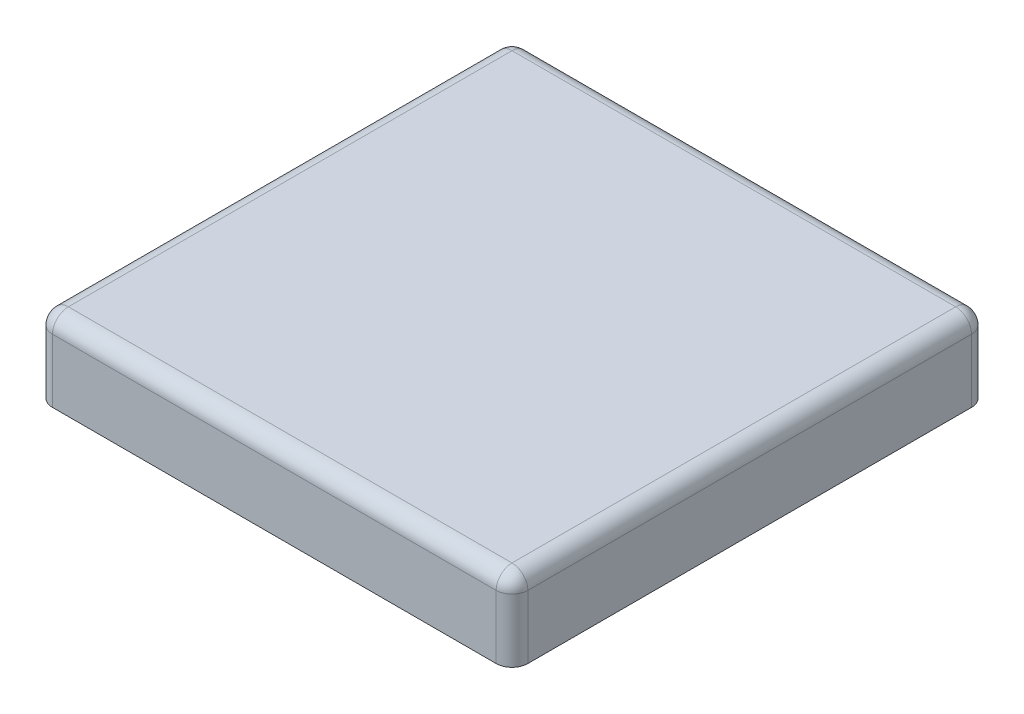
ISO-10303-21;
HEADER;
FILE_DESCRIPTION(('STEP AP214'),'2;1');
FILE_NAME('part.step','',(''),(''),'','','');
FILE_SCHEMA(('AUTOMOTIVE_DESIGN { 1 0 10303 214 1 1 1 1 }'));
ENDSEC;
DATA;
#1=APPLICATION_CONTEXT('core data for automotive mechanical design processes');
#2=APPLICATION_PROTOCOL_DEFINITION('international standard','automotive_design',2000,#1);
#3=PRODUCT_CONTEXT('',#1,'mechanical');
#4=PRODUCT('Part','Part','',(#3));
#5=PRODUCT_RELATED_PRODUCT_CATEGORY('part','',(#4));
#6=PRODUCT_DEFINITION_FORMATION('','',#4);
#7=PRODUCT_DEFINITION_CONTEXT('part definition',#1,'design');
#8=PRODUCT_DEFINITION('design','',#6,#7);
#9=PRODUCT_DEFINITION_SHAPE('','',#8);
#10=(LENGTH_UNIT() NAMED_UNIT(*) SI_UNIT(.MILLI.,.METRE.));
#11=(NAMED_UNIT(*) PLANE_ANGLE_UNIT() SI_UNIT($,.RADIAN.));
#12=(NAMED_UNIT(*) SI_UNIT($,.STERADIAN.) SOLID_ANGLE_UNIT());
#13=UNCERTAINTY_MEASURE_WITH_UNIT(LENGTH_MEASURE(1.E-05),#10,'distance_accuracy_value','');
#14=(GEOMETRIC_REPRESENTATION_CONTEXT(3) GLOBAL_UNCERTAINTY_ASSIGNED_CONTEXT((#13)) GLOBAL_UNIT_ASSIGNED_CONTEXT((#10,
#11,#12)) REPRESENTATION_CONTEXT('',''));
#15=CARTESIAN_POINT('',(0.,0.,0.));
#16=DIRECTION('',(0.,0.,1.));
#17=DIRECTION('',(1.,0.,0.));
#18=AXIS2_PLACEMENT_3D('',#15,#16,#17);
#19=CARTESIAN_POINT('',(-150.,50.,150.));
#20=DIRECTION('',(1.,0.,0.));
#21=DIRECTION('',(0.,0.,-1.));
#22=AXIS2_PLACEMENT_3D('',#19,#20,#21);
#23=PLANE('',#22);
#24=DIRECTION('',(0.,0.,1.));
#25=VECTOR('',#24,1.);
#26=CARTESIAN_POINT('',(-150.,40.,-150.));
#27=LINE('',#26,#25);
#28=CARTESIAN_POINT('',(-150.,40.,140.));
#29=VERTEX_POINT('',#28);
#30=CARTESIAN_POINT('',(-150.,40.,-140.));
#31=VERTEX_POINT('',#30);
#32=EDGE_CURVE('E182',#29,#31,#27,.F.);
#33=ORIENTED_EDGE('',*,*,#32,.T.);
#34=DIRECTION('',(0.,-1.,0.));
#35=VECTOR('',#34,1.);
#36=CARTESIAN_POINT('',(-150.,50.,-140.));
#37=LINE('',#36,#35);
#38=CARTESIAN_POINT('',(-150.,0.,-140.));
#39=VERTEX_POINT('',#38);
#40=EDGE_CURVE('E185',#31,#39,#37,.T.);
#41=ORIENTED_EDGE('',*,*,#40,.T.);
#42=DIRECTION('',(0.,0.,1.));
#43=VECTOR('',#42,1.);
#44=CARTESIAN_POINT('',(-150.,0.,150.));
#45=LINE('',#44,#43);
#46=CARTESIAN_POINT('',(-150.,0.,140.));
#47=VERTEX_POINT('',#46);
#48=EDGE_CURVE('E235',#39,#47,#45,.T.);
#49=ORIENTED_EDGE('',*,*,#48,.T.);
#50=DIRECTION('',(0.,-1.,0.));
#51=VECTOR('',#50,1.);
#52=CARTESIAN_POINT('',(-150.,50.,140.));
#53=LINE('',#52,#51);
#54=EDGE_CURVE('E179',#47,#29,#53,.F.);
#55=ORIENTED_EDGE('',*,*,#54,.T.);
#56=EDGE_LOOP('',(#33,#41,#49,#55));
#57=FACE_BOUND('',#56,.T.);
#58=ADVANCED_FACE('F39',(#57),#23,.F.);
#59=CARTESIAN_POINT('',(150.,50.,150.));
#60=DIRECTION('',(0.,0.,-1.));
#61=DIRECTION('',(-1.,0.,0.));
#62=AXIS2_PLACEMENT_3D('',#59,#60,#61);
#63=PLANE('',#62);
#64=DIRECTION('',(1.,0.,0.));
#65=VECTOR('',#64,1.);
#66=CARTESIAN_POINT('',(150.,0.,150.));
#67=LINE('',#66,#65);
#68=CARTESIAN_POINT('',(-140.,0.,150.));
#69=VERTEX_POINT('',#68);
#70=CARTESIAN_POINT('',(140.,0.,150.));
#71=VERTEX_POINT('',#70);
#72=EDGE_CURVE('E239',#69,#71,#67,.T.);
#73=ORIENTED_EDGE('',*,*,#72,.T.);
#74=DIRECTION('',(0.,-1.,0.));
#75=VECTOR('',#74,1.);
#76=CARTESIAN_POINT('',(140.,50.,150.));
#77=LINE('',#76,#75);
#78=CARTESIAN_POINT('',(140.,40.,150.));
#79=VERTEX_POINT('',#78);
#80=EDGE_CURVE('E176',#71,#79,#77,.F.);
#81=ORIENTED_EDGE('',*,*,#80,.T.);
#82=DIRECTION('',(1.,0.,0.));
#83=VECTOR('',#82,1.);
#84=CARTESIAN_POINT('',(-150.,40.,150.));
#85=LINE('',#84,#83);
#86=CARTESIAN_POINT('',(-140.,40.,150.));
#87=VERTEX_POINT('',#86);
#88=EDGE_CURVE('E173',#79,#87,#85,.F.);
#89=ORIENTED_EDGE('',*,*,#88,.T.);
#90=DIRECTION('',(0.,-1.,0.));
#91=VECTOR('',#90,1.);
#92=CARTESIAN_POINT('',(-140.,50.,150.));
#93=LINE('',#92,#91);
#94=EDGE_CURVE('E170',#87,#69,#93,.T.);
#95=ORIENTED_EDGE('',*,*,#94,.T.);
#96=EDGE_LOOP('',(#73,#81,#89,#95));
#97=FACE_BOUND('',#96,.T.);
#98=ADVANCED_FACE('F297',(#97),#63,.F.);
#99=CARTESIAN_POINT('',(150.,50.,150.));
#100=DIRECTION('',(-1.,0.,0.));
#101=DIRECTION('',(0.,0.,1.));
#102=AXIS2_PLACEMENT_3D('',#99,#100,#101);
#103=PLANE('',#102);
#104=DIRECTION('',(0.,0.,-1.));
#105=VECTOR('',#104,1.);
#106=CARTESIAN_POINT('',(150.,0.,150.));
#107=LINE('',#106,#105);
#108=CARTESIAN_POINT('',(150.,0.,140.));
#109=VERTEX_POINT('',#108);
#110=CARTESIAN_POINT('',(150.,0.,-140.));
#111=VERTEX_POINT('',#110);
#112=EDGE_CURVE('E246',#109,#111,#107,.T.);
#113=ORIENTED_EDGE('',*,*,#112,.T.);
#114=DIRECTION('',(0.,-1.,0.));
#115=VECTOR('',#114,1.);
#116=CARTESIAN_POINT('',(150.,50.,-140.));
#117=LINE('',#116,#115);
#118=CARTESIAN_POINT('',(150.,40.,-140.));
#119=VERTEX_POINT('',#118);
#120=EDGE_CURVE('E167',#111,#119,#117,.F.);
#121=ORIENTED_EDGE('',*,*,#120,.T.);
#122=DIRECTION('',(0.,0.,-1.));
#123=VECTOR('',#122,1.);
#124=CARTESIAN_POINT('',(150.,40.,150.));
#125=LINE('',#124,#123);
#126=CARTESIAN_POINT('',(150.,40.,140.));
#127=VERTEX_POINT('',#126);
#128=EDGE_CURVE('E125',#119,#127,#125,.F.);
#129=ORIENTED_EDGE('',*,*,#128,.T.);
#130=DIRECTION('',(0.,-1.,0.));
#131=VECTOR('',#130,1.);
#132=CARTESIAN_POINT('',(150.,50.,140.));
#133=LINE('',#132,#131);
#134=EDGE_CURVE('E157',#127,#109,#133,.T.);
#135=ORIENTED_EDGE('',*,*,#134,.T.);
#136=EDGE_LOOP('',(#113,#121,#129,#135));
#137=FACE_BOUND('',#136,.T.);
#138=ADVANCED_FACE('F273',(#137),#103,.F.);
#139=CARTESIAN_POINT('',(150.,50.,-150.));
#140=DIRECTION('',(0.,0.,1.));
#141=DIRECTION('',(1.,0.,0.));
#142=AXIS2_PLACEMENT_3D('',#139,#140,#141);
#143=PLANE('',#142);
#144=DIRECTION('',(-1.,0.,0.));
#145=VECTOR('',#144,1.);
#146=CARTESIAN_POINT('',(150.,0.,-150.));
#147=LINE('',#146,#145);
#148=CARTESIAN_POINT('',(140.,0.,-150.));
#149=VERTEX_POINT('',#148);
#150=CARTESIAN_POINT('',(-140.,0.,-150.));
#151=VERTEX_POINT('',#150);
#152=EDGE_CURVE('E150',#149,#151,#147,.T.);
#153=ORIENTED_EDGE('',*,*,#152,.T.);
#154=DIRECTION('',(0.,-1.,0.));
#155=VECTOR('',#154,1.);
#156=CARTESIAN_POINT('',(-140.,50.,-150.));
#157=LINE('',#156,#155);
#158=CARTESIAN_POINT('',(-140.,40.,-150.));
#159=VERTEX_POINT('',#158);
#160=EDGE_CURVE('E57',#151,#159,#157,.F.);
#161=ORIENTED_EDGE('',*,*,#160,.T.);
#162=DIRECTION('',(-1.,0.,0.));
#163=VECTOR('',#162,1.);
#164=CARTESIAN_POINT('',(150.,40.,-150.));
#165=LINE('',#164,#163);
#166=CARTESIAN_POINT('',(140.,40.,-150.));
#167=VERTEX_POINT('',#166);
#168=EDGE_CURVE('E62',#159,#167,#165,.F.);
#169=ORIENTED_EDGE('',*,*,#168,.T.);
#170=DIRECTION('',(0.,-1.,0.));
#171=VECTOR('',#170,1.);
#172=CARTESIAN_POINT('',(140.,50.,-150.));
#173=LINE('',#172,#171);
#174=EDGE_CURVE('E188',#167,#149,#173,.T.);
#175=ORIENTED_EDGE('',*,*,#174,.T.);
#176=EDGE_LOOP('',(#153,#161,#169,#175));
#177=FACE_BOUND('',#176,.T.);
#178=ADVANCED_FACE('F279',(#177),#143,.F.);
#179=CARTESIAN_POINT('',(0.,50.,0.));
#180=DIRECTION('',(0.,1.,0.));
#181=DIRECTION('',(0.,0.,1.));
#182=AXIS2_PLACEMENT_3D('',#179,#180,#181);
#183=PLANE('',#182);
#184=DIRECTION('',(1.,0.,0.));
#185=VECTOR('',#184,1.);
#186=CARTESIAN_POINT('',(150.,50.,140.));
#187=LINE('',#186,#185);
#188=CARTESIAN_POINT('',(-140.,50.,140.));
#189=VERTEX_POINT('',#188);
#190=CARTESIAN_POINT('',(140.,50.,140.));
#191=VERTEX_POINT('',#190);
#192=EDGE_CURVE('E154',#189,#191,#187,.T.);
#193=ORIENTED_EDGE('',*,*,#192,.T.);
#194=DIRECTION('',(0.,0.,-1.));
#195=VECTOR('',#194,1.);
#196=CARTESIAN_POINT('',(140.,50.,-150.));
#197=LINE('',#196,#195);
#198=CARTESIAN_POINT('',(140.,50.,-140.));
#199=VERTEX_POINT('',#198);
#200=EDGE_CURVE('E123',#191,#199,#197,.T.);
#201=ORIENTED_EDGE('',*,*,#200,.T.);
#202=DIRECTION('',(-1.,0.,0.));
#203=VECTOR('',#202,1.);
#204=CARTESIAN_POINT('',(-150.,50.,-140.));
#205=LINE('',#204,#203);
#206=CARTESIAN_POINT('',(-140.,50.,-140.));
#207=VERTEX_POINT('',#206);
#208=EDGE_CURVE('E142',#199,#207,#205,.T.);
#209=ORIENTED_EDGE('',*,*,#208,.T.);
#210=DIRECTION('',(0.,0.,1.));
#211=VECTOR('',#210,1.);
#212=CARTESIAN_POINT('',(-140.,50.,150.));
#213=LINE('',#212,#211);
#214=EDGE_CURVE('E149',#207,#189,#213,.T.);
#215=ORIENTED_EDGE('',*,*,#214,.T.);
#216=EDGE_LOOP('',(#193,#201,#209,#215));
#217=FACE_BOUND('',#216,.T.);
#218=ADVANCED_FACE('F152',(#217),#183,.T.);
#219=CARTESIAN_POINT('',(0.,0.,0.));
#220=DIRECTION('',(0.,1.,0.));
#221=DIRECTION('',(0.,0.,1.));
#222=AXIS2_PLACEMENT_3D('',#219,#220,#221);
#223=PLANE('',#222);
#224=ORIENTED_EDGE('',*,*,#48,.F.);
#225=CARTESIAN_POINT('',(-140.,0.,-140.));
#226=DIRECTION('',(0.,1.,0.));
#227=DIRECTION('',(0.,0.,1.));
#228=AXIS2_PLACEMENT_3D('',#225,#226,#227);
#229=CIRCLE('',#228,10.);
#230=EDGE_CURVE('E11',#39,#151,#229,.F.);
#231=ORIENTED_EDGE('',*,*,#230,.T.);
#232=ORIENTED_EDGE('',*,*,#152,.F.);
#233=CARTESIAN_POINT('',(140.,0.,-140.));
#234=DIRECTION('',(0.,1.,0.));
#235=DIRECTION('',(0.,0.,1.));
#236=AXIS2_PLACEMENT_3D('',#233,#234,#235);
#237=CIRCLE('',#236,10.);
#238=EDGE_CURVE('E49',#149,#111,#237,.F.);
#239=ORIENTED_EDGE('',*,*,#238,.T.);
#240=ORIENTED_EDGE('',*,*,#112,.F.);
#241=CARTESIAN_POINT('',(140.,0.,140.));
#242=DIRECTION('',(0.,1.,0.));
#243=DIRECTION('',(0.,0.,1.));
#244=AXIS2_PLACEMENT_3D('',#241,#242,#243);
#245=CIRCLE('',#244,10.);
#246=EDGE_CURVE('E198',#109,#71,#245,.F.);
#247=ORIENTED_EDGE('',*,*,#246,.T.);
#248=ORIENTED_EDGE('',*,*,#72,.F.);
#249=CARTESIAN_POINT('',(-140.,0.,140.));
#250=DIRECTION('',(0.,1.,0.));
#251=DIRECTION('',(0.,0.,1.));
#252=AXIS2_PLACEMENT_3D('',#249,#250,#251);
#253=CIRCLE('',#252,10.);
#254=EDGE_CURVE('E195',#69,#47,#253,.F.);
#255=ORIENTED_EDGE('',*,*,#254,.T.);
#256=EDGE_LOOP('',(#224,#231,#232,#239,#240,#247,#248,#255));
#257=FACE_BOUND('',#256,.T.);
#258=ADVANCED_FACE('F281',(#257),#223,.F.);
#259=CARTESIAN_POINT('',(-140.,50.,140.));
#260=DIRECTION('',(0.,-1.,0.));
#261=DIRECTION('',(0.,0.,-1.));
#262=AXIS2_PLACEMENT_3D('',#259,#260,#261);
#263=CYLINDRICAL_SURFACE('',#262,10.);
#264=ORIENTED_EDGE('',*,*,#254,.F.);
#265=ORIENTED_EDGE('',*,*,#94,.F.);
#266=CARTESIAN_POINT('',(-140.,40.,140.));
#267=DIRECTION('',(0.,1.,0.));
#268=DIRECTION('',(0.,0.,1.));
#269=AXIS2_PLACEMENT_3D('',#266,#267,#268);
#270=CIRCLE('',#269,10.);
#271=EDGE_CURVE('E43',#29,#87,#270,.T.);
#272=ORIENTED_EDGE('',*,*,#271,.F.);
#273=ORIENTED_EDGE('',*,*,#54,.F.);
#274=EDGE_LOOP('',(#264,#265,#272,#273));
#275=FACE_BOUND('',#274,.T.);
#276=ADVANCED_FACE('F41',(#275),#263,.T.);
#277=CARTESIAN_POINT('',(-140.,40.,0.));
#278=DIRECTION('',(0.,0.,-1.));
#279=DIRECTION('',(-1.,0.,0.));
#280=AXIS2_PLACEMENT_3D('',#277,#278,#279);
#281=CYLINDRICAL_SURFACE('',#280,10.);
#282=CARTESIAN_POINT('',(-140.,40.,-140.));
#283=DIRECTION('',(0.,0.,-1.));
#284=DIRECTION('',(-1.,0.,0.));
#285=AXIS2_PLACEMENT_3D('',#282,#283,#284);
#286=CIRCLE('',#285,10.);
#287=EDGE_CURVE('E224',#31,#207,#286,.T.);
#288=ORIENTED_EDGE('',*,*,#287,.F.);
#289=ORIENTED_EDGE('',*,*,#32,.F.);
#290=CARTESIAN_POINT('',(-140.,40.,140.));
#291=DIRECTION('',(0.,0.,1.));
#292=DIRECTION('',(1.,0.,0.));
#293=AXIS2_PLACEMENT_3D('',#290,#291,#292);
#294=CIRCLE('',#293,10.);
#295=EDGE_CURVE('E227',#189,#29,#294,.T.);
#296=ORIENTED_EDGE('',*,*,#295,.F.);
#297=ORIENTED_EDGE('',*,*,#214,.F.);
#298=EDGE_LOOP('',(#288,#289,#296,#297));
#299=FACE_BOUND('',#298,.T.);
#300=ADVANCED_FACE('F257',(#299),#281,.T.);
#301=CARTESIAN_POINT('',(-140.,50.,-140.));
#302=DIRECTION('',(0.,-1.,0.));
#303=DIRECTION('',(0.,0.,-1.));
#304=AXIS2_PLACEMENT_3D('',#301,#302,#303);
#305=CYLINDRICAL_SURFACE('',#304,10.);
#306=ORIENTED_EDGE('',*,*,#230,.F.);
#307=ORIENTED_EDGE('',*,*,#40,.F.);
#308=CARTESIAN_POINT('',(-140.,40.,-140.));
#309=DIRECTION('',(0.,1.,0.));
#310=DIRECTION('',(0.,0.,1.));
#311=AXIS2_PLACEMENT_3D('',#308,#309,#310);
#312=CIRCLE('',#311,10.);
#313=EDGE_CURVE('E220',#159,#31,#312,.T.);
#314=ORIENTED_EDGE('',*,*,#313,.F.);
#315=ORIENTED_EDGE('',*,*,#160,.F.);
#316=EDGE_LOOP('',(#306,#307,#314,#315));
#317=FACE_BOUND('',#316,.T.);
#318=ADVANCED_FACE('F285',(#317),#305,.T.);
#319=CARTESIAN_POINT('',(-140.,40.,140.));
#320=DIRECTION('',(-1.,0.,0.));
#321=DIRECTION('',(0.,0.,1.));
#322=AXIS2_PLACEMENT_3D('',#319,#320,#321);
#323=SPHERICAL_SURFACE('',#322,10.);
#324=ORIENTED_EDGE('',*,*,#295,.T.);
#325=ORIENTED_EDGE('',*,*,#271,.T.);
#326=CARTESIAN_POINT('',(-140.,40.,140.));
#327=DIRECTION('',(-1.,0.,0.));
#328=DIRECTION('',(0.,0.,1.));
#329=AXIS2_PLACEMENT_3D('',#326,#327,#328);
#330=CIRCLE('',#329,10.);
#331=EDGE_CURVE('E216',#189,#87,#330,.F.);
#332=ORIENTED_EDGE('',*,*,#331,.F.);
#333=EDGE_LOOP('',(#324,#325,#332));
#334=FACE_BOUND('',#333,.T.);
#335=ADVANCED_FACE('F258',(#334),#323,.T.);
#336=CARTESIAN_POINT('',(-140.,40.,-140.));
#337=DIRECTION('',(-1.,0.,0.));
#338=DIRECTION('',(0.,0.,1.));
#339=AXIS2_PLACEMENT_3D('',#336,#337,#338);
#340=SPHERICAL_SURFACE('',#339,10.);
#341=ORIENTED_EDGE('',*,*,#313,.T.);
#342=ORIENTED_EDGE('',*,*,#287,.T.);
#343=CARTESIAN_POINT('',(-140.,40.,-140.));
#344=DIRECTION('',(-1.,0.,0.));
#345=DIRECTION('',(0.,0.,1.));
#346=AXIS2_PLACEMENT_3D('',#343,#344,#345);
#347=CIRCLE('',#346,10.);
#348=EDGE_CURVE('E145',#159,#207,#347,.F.);
#349=ORIENTED_EDGE('',*,*,#348,.F.);
#350=EDGE_LOOP('',(#341,#342,#349));
#351=FACE_BOUND('',#350,.T.);
#352=ADVANCED_FACE('F287',(#351),#340,.T.);
#353=CARTESIAN_POINT('',(140.,50.,140.));
#354=DIRECTION('',(0.,-1.,0.));
#355=DIRECTION('',(0.,0.,-1.));
#356=AXIS2_PLACEMENT_3D('',#353,#354,#355);
#357=CYLINDRICAL_SURFACE('',#356,10.);
#358=ORIENTED_EDGE('',*,*,#246,.F.);
#359=ORIENTED_EDGE('',*,*,#134,.F.);
#360=CARTESIAN_POINT('',(140.,40.,140.));
#361=DIRECTION('',(0.,1.,0.));
#362=DIRECTION('',(0.,0.,1.));
#363=AXIS2_PLACEMENT_3D('',#360,#361,#362);
#364=CIRCLE('',#363,10.);
#365=EDGE_CURVE('E210',#79,#127,#364,.T.);
#366=ORIENTED_EDGE('',*,*,#365,.F.);
#367=ORIENTED_EDGE('',*,*,#80,.F.);
#368=EDGE_LOOP('',(#358,#359,#366,#367));
#369=FACE_BOUND('',#368,.T.);
#370=ADVANCED_FACE('F270',(#369),#357,.T.);
#371=CARTESIAN_POINT('',(0.,40.,140.));
#372=DIRECTION('',(-1.,0.,0.));
#373=DIRECTION('',(0.,0.,1.));
#374=AXIS2_PLACEMENT_3D('',#371,#372,#373);
#375=CYLINDRICAL_SURFACE('',#374,10.);
#376=ORIENTED_EDGE('',*,*,#331,.T.);
#377=ORIENTED_EDGE('',*,*,#88,.F.);
#378=CARTESIAN_POINT('',(140.,40.,140.));
#379=DIRECTION('',(1.,0.,0.));
#380=DIRECTION('',(0.,0.,-1.));
#381=AXIS2_PLACEMENT_3D('',#378,#379,#380);
#382=CIRCLE('',#381,10.);
#383=EDGE_CURVE('E139',#191,#79,#382,.T.);
#384=ORIENTED_EDGE('',*,*,#383,.F.);
#385=ORIENTED_EDGE('',*,*,#192,.F.);
#386=EDGE_LOOP('',(#376,#377,#384,#385));
#387=FACE_BOUND('',#386,.T.);
#388=ADVANCED_FACE('F261',(#387),#375,.T.);
#389=CARTESIAN_POINT('',(0.,40.,-140.));
#390=DIRECTION('',(1.,0.,0.));
#391=DIRECTION('',(0.,0.,-1.));
#392=AXIS2_PLACEMENT_3D('',#389,#390,#391);
#393=CYLINDRICAL_SURFACE('',#392,10.);
#394=ORIENTED_EDGE('',*,*,#348,.T.);
#395=ORIENTED_EDGE('',*,*,#208,.F.);
#396=CARTESIAN_POINT('',(140.,40.,-140.));
#397=DIRECTION('',(1.,0.,0.));
#398=DIRECTION('',(0.,0.,-1.));
#399=AXIS2_PLACEMENT_3D('',#396,#397,#398);
#400=CIRCLE('',#399,10.);
#401=EDGE_CURVE('E132',#167,#199,#400,.T.);
#402=ORIENTED_EDGE('',*,*,#401,.F.);
#403=ORIENTED_EDGE('',*,*,#168,.F.);
#404=EDGE_LOOP('',(#394,#395,#402,#403));
#405=FACE_BOUND('',#404,.T.);
#406=ADVANCED_FACE('F143',(#405),#393,.T.);
#407=CARTESIAN_POINT('',(140.,50.,-140.));
#408=DIRECTION('',(0.,-1.,0.));
#409=DIRECTION('',(0.,0.,-1.));
#410=AXIS2_PLACEMENT_3D('',#407,#408,#409);
#411=CYLINDRICAL_SURFACE('',#410,10.);
#412=ORIENTED_EDGE('',*,*,#238,.F.);
#413=ORIENTED_EDGE('',*,*,#174,.F.);
#414=CARTESIAN_POINT('',(140.,40.,-140.));
#415=DIRECTION('',(0.,1.,0.));
#416=DIRECTION('',(0.,0.,1.));
#417=AXIS2_PLACEMENT_3D('',#414,#415,#416);
#418=CIRCLE('',#417,10.);
#419=EDGE_CURVE('E136',#119,#167,#418,.T.);
#420=ORIENTED_EDGE('',*,*,#419,.F.);
#421=ORIENTED_EDGE('',*,*,#120,.F.);
#422=EDGE_LOOP('',(#412,#413,#420,#421));
#423=FACE_BOUND('',#422,.T.);
#424=ADVANCED_FACE('F277',(#423),#411,.T.);
#425=CARTESIAN_POINT('',(140.,40.,140.));
#426=DIRECTION('',(0.,0.,1.));
#427=DIRECTION('',(1.,0.,0.));
#428=AXIS2_PLACEMENT_3D('',#425,#426,#427);
#429=SPHERICAL_SURFACE('',#428,10.);
#430=ORIENTED_EDGE('',*,*,#383,.T.);
#431=ORIENTED_EDGE('',*,*,#365,.T.);
#432=CARTESIAN_POINT('',(140.,40.,140.));
#433=DIRECTION('',(0.,0.,1.));
#434=DIRECTION('',(1.,0.,0.));
#435=AXIS2_PLACEMENT_3D('',#432,#433,#434);
#436=CIRCLE('',#435,10.);
#437=EDGE_CURVE('E129',#191,#127,#436,.F.);
#438=ORIENTED_EDGE('',*,*,#437,.F.);
#439=EDGE_LOOP('',(#430,#431,#438));
#440=FACE_BOUND('',#439,.T.);
#441=ADVANCED_FACE('F265',(#440),#429,.T.);
#442=CARTESIAN_POINT('',(140.,40.,-140.));
#443=DIRECTION('',(0.,0.,-1.));
#444=DIRECTION('',(-1.,0.,0.));
#445=AXIS2_PLACEMENT_3D('',#442,#443,#444);
#446=SPHERICAL_SURFACE('',#445,10.);
#447=ORIENTED_EDGE('',*,*,#419,.T.);
#448=ORIENTED_EDGE('',*,*,#401,.T.);
#449=CARTESIAN_POINT('',(140.,40.,-140.));
#450=DIRECTION('',(0.,0.,-1.));
#451=DIRECTION('',(-1.,0.,0.));
#452=AXIS2_PLACEMENT_3D('',#449,#450,#451);
#453=CIRCLE('',#452,10.);
#454=EDGE_CURVE('E119',#119,#199,#453,.F.);
#455=ORIENTED_EDGE('',*,*,#454,.F.);
#456=EDGE_LOOP('',(#447,#448,#455));
#457=FACE_BOUND('',#456,.T.);
#458=ADVANCED_FACE('F134',(#457),#446,.T.);
#459=CARTESIAN_POINT('',(140.,40.,0.));
#460=DIRECTION('',(0.,0.,1.));
#461=DIRECTION('',(1.,0.,0.));
#462=AXIS2_PLACEMENT_3D('',#459,#460,#461);
#463=CYLINDRICAL_SURFACE('',#462,10.);
#464=ORIENTED_EDGE('',*,*,#437,.T.);
#465=ORIENTED_EDGE('',*,*,#128,.F.);
#466=ORIENTED_EDGE('',*,*,#454,.T.);
#467=ORIENTED_EDGE('',*,*,#200,.F.);
#468=EDGE_LOOP('',(#464,#465,#466,#467));
#469=FACE_BOUND('',#468,.T.);
#470=ADVANCED_FACE('F121',(#469),#463,.T.);
#471=CLOSED_SHELL('',(#58,#98,#138,#178,#218,#258,#276,#300,#318,#335,#352,#370,#388,#406,#424,
#441,#458,#470));
#472=MANIFOLD_SOLID_BREP('B2',#471);
#473=ADVANCED_BREP_SHAPE_REPRESENTATION('',(#18,#472),#14);
#474=SHAPE_DEFINITION_REPRESENTATION(#9,#473);
ENDSEC;
END-ISO-10303-21;
